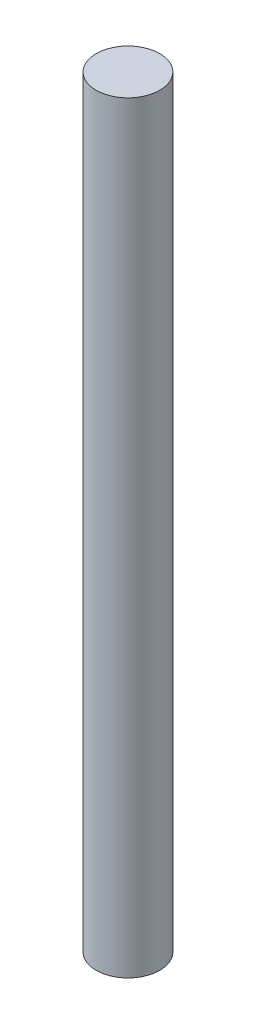
ISO-10303-21;
HEADER;
FILE_DESCRIPTION(('STEP AP214'),'2;1');
FILE_NAME('part.step','',(''),(''),'','','');
FILE_SCHEMA(('AUTOMOTIVE_DESIGN { 1 0 10303 214 1 1 1 1 }'));
ENDSEC;
DATA;
#1=APPLICATION_CONTEXT('core data for automotive mechanical design processes');
#2=APPLICATION_PROTOCOL_DEFINITION('international standard','automotive_design',2000,#1);
#3=PRODUCT_CONTEXT('',#1,'mechanical');
#4=PRODUCT('Part','Part','',(#3));
#5=PRODUCT_RELATED_PRODUCT_CATEGORY('part','',(#4));
#6=PRODUCT_DEFINITION_FORMATION('','',#4);
#7=PRODUCT_DEFINITION_CONTEXT('part definition',#1,'design');
#8=PRODUCT_DEFINITION('design','',#6,#7);
#9=PRODUCT_DEFINITION_SHAPE('','',#8);
#10=(LENGTH_UNIT() NAMED_UNIT(*) SI_UNIT(.MILLI.,.METRE.));
#11=(NAMED_UNIT(*) PLANE_ANGLE_UNIT() SI_UNIT($,.RADIAN.));
#12=(NAMED_UNIT(*) SI_UNIT($,.STERADIAN.) SOLID_ANGLE_UNIT());
#13=UNCERTAINTY_MEASURE_WITH_UNIT(LENGTH_MEASURE(1.E-05),#10,'distance_accuracy_value','');
#14=(GEOMETRIC_REPRESENTATION_CONTEXT(3) GLOBAL_UNCERTAINTY_ASSIGNED_CONTEXT((#13)) GLOBAL_UNIT_ASSIGNED_CONTEXT((#10,
#11,#12)) REPRESENTATION_CONTEXT('',''));
#15=CARTESIAN_POINT('',(0.,0.,0.));
#16=DIRECTION('',(0.,0.,1.));
#17=DIRECTION('',(1.,0.,0.));
#18=AXIS2_PLACEMENT_3D('',#15,#16,#17);
#19=CARTESIAN_POINT('',(0.,720.,0.));
#20=DIRECTION('',(0.,-1.,0.));
#21=DIRECTION('',(0.,0.,-1.));
#22=AXIS2_PLACEMENT_3D('',#19,#20,#21);
#23=CYLINDRICAL_SURFACE('',#22,30.);
#24=CARTESIAN_POINT('',(0.,720.,0.));
#25=DIRECTION('',(0.,1.,0.));
#26=DIRECTION('',(0.,0.,1.));
#27=AXIS2_PLACEMENT_3D('',#24,#25,#26);
#28=CIRCLE('',#27,30.);
#29=CARTESIAN_POINT('',(0.,720.,30.));
#30=VERTEX_POINT('',#29);
#31=EDGE_CURVE('E10',#30,#30,#28,.T.);
#32=ORIENTED_EDGE('',*,*,#31,.F.);
#33=EDGE_LOOP('',(#32));
#34=FACE_BOUND('',#33,.T.);
#35=CARTESIAN_POINT('',(0.,0.,0.));
#36=DIRECTION('',(0.,1.,0.));
#37=DIRECTION('',(0.,0.,1.));
#38=AXIS2_PLACEMENT_3D('',#35,#36,#37);
#39=CIRCLE('',#38,30.);
#40=CARTESIAN_POINT('',(0.,0.,30.));
#41=VERTEX_POINT('',#40);
#42=EDGE_CURVE('E44',#41,#41,#39,.T.);
#43=ORIENTED_EDGE('',*,*,#42,.T.);
#44=EDGE_LOOP('',(#43));
#45=FACE_BOUND('',#44,.T.);
#46=ADVANCED_FACE('F41',(#34,#45),#23,.T.);
#47=CARTESIAN_POINT('',(0.,720.,0.));
#48=DIRECTION('',(0.,1.,0.));
#49=DIRECTION('',(0.,0.,1.));
#50=AXIS2_PLACEMENT_3D('',#47,#48,#49);
#51=PLANE('',#50);
#52=ORIENTED_EDGE('',*,*,#31,.T.);
#53=EDGE_LOOP('',(#52));
#54=FACE_BOUND('',#53,.T.);
#55=ADVANCED_FACE('F58',(#54),#51,.T.);
#56=CARTESIAN_POINT('',(0.,0.,0.));
#57=DIRECTION('',(0.,1.,0.));
#58=DIRECTION('',(0.,0.,1.));
#59=AXIS2_PLACEMENT_3D('',#56,#57,#58);
#60=PLANE('',#59);
#61=ORIENTED_EDGE('',*,*,#42,.F.);
#62=EDGE_LOOP('',(#61));
#63=FACE_BOUND('',#62,.T.);
#64=ADVANCED_FACE('F56',(#63),#60,.F.);
#65=CLOSED_SHELL('',(#46,#55,#64));
#66=MANIFOLD_SOLID_BREP('B2',#65);
#67=ADVANCED_BREP_SHAPE_REPRESENTATION('',(#18,#66),#14);
#68=SHAPE_DEFINITION_REPRESENTATION(#9,#67);
ENDSEC;
END-ISO-10303-21;
